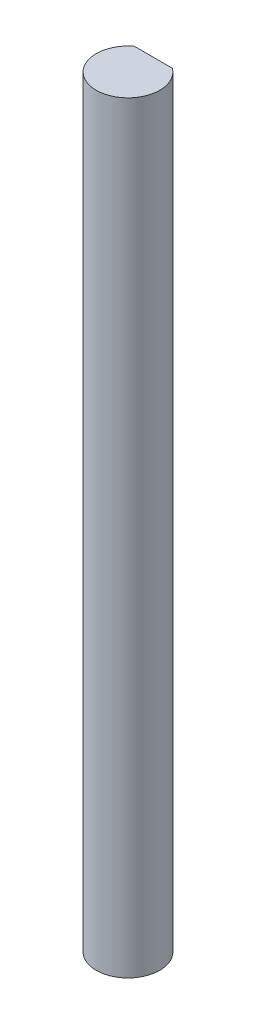
ISO-10303-21;
HEADER;
FILE_DESCRIPTION(('STEP AP214'),'2;1');
FILE_NAME('part.step','',(''),(''),'','','');
FILE_SCHEMA(('AUTOMOTIVE_DESIGN { 1 0 10303 214 1 1 1 1 }'));
ENDSEC;
DATA;
#1=APPLICATION_CONTEXT('core data for automotive mechanical design processes');
#2=APPLICATION_PROTOCOL_DEFINITION('international standard','automotive_design',2000,#1);
#3=PRODUCT_CONTEXT('',#1,'mechanical');
#4=PRODUCT('Part','Part','',(#3));
#5=PRODUCT_RELATED_PRODUCT_CATEGORY('part','',(#4));
#6=PRODUCT_DEFINITION_FORMATION('','',#4);
#7=PRODUCT_DEFINITION_CONTEXT('part definition',#1,'design');
#8=PRODUCT_DEFINITION('design','',#6,#7);
#9=PRODUCT_DEFINITION_SHAPE('','',#8);
#10=(LENGTH_UNIT() NAMED_UNIT(*) SI_UNIT(.MILLI.,.METRE.));
#11=(NAMED_UNIT(*) PLANE_ANGLE_UNIT() SI_UNIT($,.RADIAN.));
#12=(NAMED_UNIT(*) SI_UNIT($,.STERADIAN.) SOLID_ANGLE_UNIT());
#13=UNCERTAINTY_MEASURE_WITH_UNIT(LENGTH_MEASURE(1.E-05),#10,'distance_accuracy_value','');
#14=(GEOMETRIC_REPRESENTATION_CONTEXT(3) GLOBAL_UNCERTAINTY_ASSIGNED_CONTEXT((#13)) GLOBAL_UNIT_ASSIGNED_CONTEXT((#10,
#11,#12)) REPRESENTATION_CONTEXT('',''));
#15=CARTESIAN_POINT('',(0.,0.,0.));
#16=DIRECTION('',(0.,0.,1.));
#17=DIRECTION('',(1.,0.,0.));
#18=AXIS2_PLACEMENT_3D('',#15,#16,#17);
#19=CARTESIAN_POINT('',(0.,76.2,0.));
#20=DIRECTION('',(0.,-1.,0.));
#21=DIRECTION('',(0.,0.,-1.));
#22=AXIS2_PLACEMENT_3D('',#19,#20,#21);
#23=CYLINDRICAL_SURFACE('',#22,3.175);
#24=CARTESIAN_POINT('',(0.,0.,0.));
#25=DIRECTION('',(0.,1.,0.));
#26=DIRECTION('',(0.,0.,1.));
#27=AXIS2_PLACEMENT_3D('',#24,#25,#26);
#28=CIRCLE('',#27,3.175);
#29=CARTESIAN_POINT('',(-1.905,0.,-2.54));
#30=VERTEX_POINT('',#29);
#31=CARTESIAN_POINT('',(1.905,0.,-2.54));
#32=VERTEX_POINT('',#31);
#33=EDGE_CURVE('E64',#30,#32,#28,.T.);
#34=ORIENTED_EDGE('',*,*,#33,.T.);
#35=DIRECTION('',(0.,-1.,0.));
#36=VECTOR('',#35,1.);
#37=CARTESIAN_POINT('',(1.905,76.2,-2.54));
#38=LINE('',#37,#36);
#39=CARTESIAN_POINT('',(1.905,76.2,-2.54));
#40=VERTEX_POINT('',#39);
#41=EDGE_CURVE('E11',#40,#32,#38,.T.);
#42=ORIENTED_EDGE('',*,*,#41,.F.);
#43=CARTESIAN_POINT('',(0.,76.2,0.));
#44=DIRECTION('',(0.,1.,0.));
#45=DIRECTION('',(0.,0.,1.));
#46=AXIS2_PLACEMENT_3D('',#43,#44,#45);
#47=CIRCLE('',#46,3.175);
#48=CARTESIAN_POINT('',(-1.905,76.2,-2.54));
#49=VERTEX_POINT('',#48);
#50=EDGE_CURVE('E63',#49,#40,#47,.T.);
#51=ORIENTED_EDGE('',*,*,#50,.F.);
#52=DIRECTION('',(0.,-1.,0.));
#53=VECTOR('',#52,1.);
#54=CARTESIAN_POINT('',(-1.905,76.2,-2.54));
#55=LINE('',#54,#53);
#56=EDGE_CURVE('E41',#49,#30,#55,.T.);
#57=ORIENTED_EDGE('',*,*,#56,.T.);
#58=EDGE_LOOP('',(#34,#42,#51,#57));
#59=FACE_BOUND('',#58,.T.);
#60=ADVANCED_FACE('F33',(#59),#23,.T.);
#61=CARTESIAN_POINT('',(-1.905,76.2,-2.54));
#62=DIRECTION('',(0.,0.,1.));
#63=DIRECTION('',(1.,0.,0.));
#64=AXIS2_PLACEMENT_3D('',#61,#62,#63);
#65=PLANE('',#64);
#66=DIRECTION('',(-1.,0.,0.));
#67=VECTOR('',#66,1.);
#68=CARTESIAN_POINT('',(-1.905,0.,-2.54));
#69=LINE('',#68,#67);
#70=EDGE_CURVE('E56',#32,#30,#69,.T.);
#71=ORIENTED_EDGE('',*,*,#70,.T.);
#72=ORIENTED_EDGE('',*,*,#56,.F.);
#73=DIRECTION('',(-1.,0.,0.));
#74=VECTOR('',#73,1.);
#75=CARTESIAN_POINT('',(-1.905,76.2,-2.54));
#76=LINE('',#75,#74);
#77=EDGE_CURVE('E48',#40,#49,#76,.T.);
#78=ORIENTED_EDGE('',*,*,#77,.F.);
#79=ORIENTED_EDGE('',*,*,#41,.T.);
#80=EDGE_LOOP('',(#71,#72,#78,#79));
#81=FACE_BOUND('',#80,.T.);
#82=ADVANCED_FACE('F59',(#81),#65,.F.);
#83=CARTESIAN_POINT('',(0.,76.2,0.));
#84=DIRECTION('',(0.,1.,0.));
#85=DIRECTION('',(0.,0.,1.));
#86=AXIS2_PLACEMENT_3D('',#83,#84,#85);
#87=PLANE('',#86);
#88=ORIENTED_EDGE('',*,*,#50,.T.);
#89=ORIENTED_EDGE('',*,*,#77,.T.);
#90=EDGE_LOOP('',(#88,#89));
#91=FACE_BOUND('',#90,.T.);
#92=ADVANCED_FACE('F71',(#91),#87,.T.);
#93=CARTESIAN_POINT('',(0.,0.,0.));
#94=DIRECTION('',(0.,1.,0.));
#95=DIRECTION('',(0.,0.,1.));
#96=AXIS2_PLACEMENT_3D('',#93,#94,#95);
#97=PLANE('',#96);
#98=ORIENTED_EDGE('',*,*,#33,.F.);
#99=ORIENTED_EDGE('',*,*,#70,.F.);
#100=EDGE_LOOP('',(#98,#99));
#101=FACE_BOUND('',#100,.T.);
#102=ADVANCED_FACE('F67',(#101),#97,.F.);
#103=CLOSED_SHELL('',(#60,#82,#92,#102));
#104=MANIFOLD_SOLID_BREP('B2',#103);
#105=ADVANCED_BREP_SHAPE_REPRESENTATION('',(#18,#104),#14);
#106=SHAPE_DEFINITION_REPRESENTATION(#9,#105);
ENDSEC;
END-ISO-10303-21;
